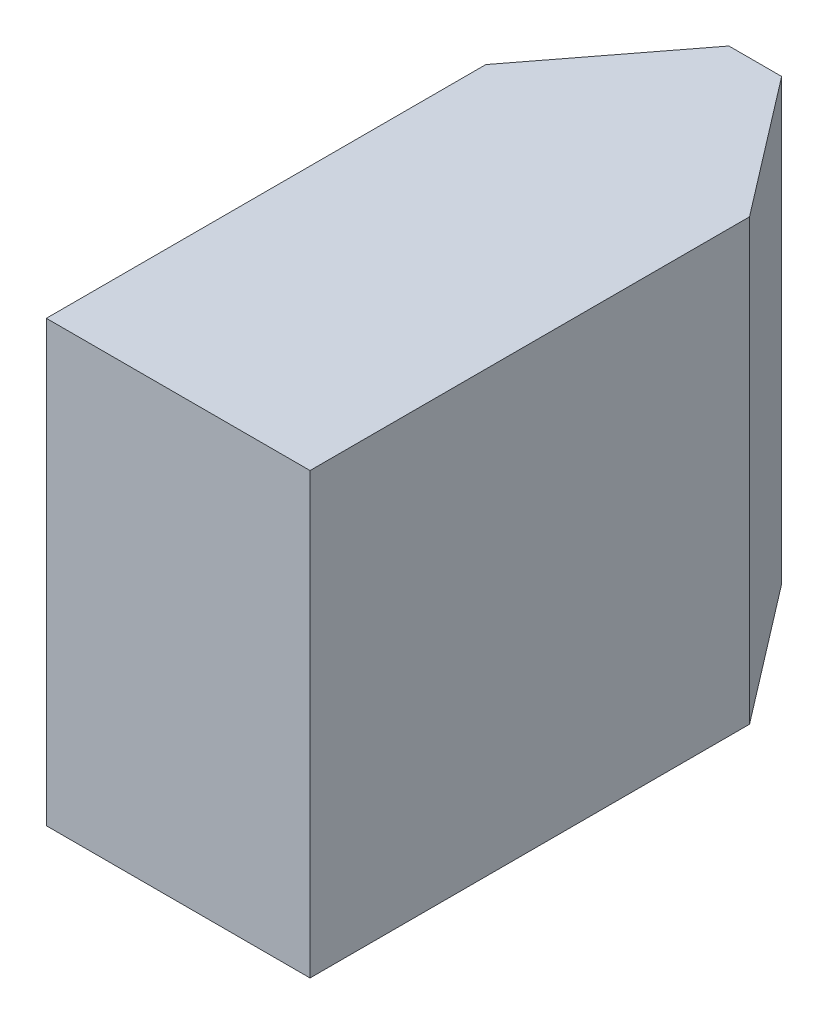
ISO-10303-21;
HEADER;
FILE_DESCRIPTION(('STEP AP214'),'2;1');
FILE_NAME('part.step','',(''),(''),'','','');
FILE_SCHEMA(('AUTOMOTIVE_DESIGN { 1 0 10303 214 1 1 1 1 }'));
ENDSEC;
DATA;
#1=APPLICATION_CONTEXT('core data for automotive mechanical design processes');
#2=APPLICATION_PROTOCOL_DEFINITION('international standard','automotive_design',2000,#1);
#3=PRODUCT_CONTEXT('',#1,'mechanical');
#4=PRODUCT('Part','Part','',(#3));
#5=PRODUCT_RELATED_PRODUCT_CATEGORY('part','',(#4));
#6=PRODUCT_DEFINITION_FORMATION('','',#4);
#7=PRODUCT_DEFINITION_CONTEXT('part definition',#1,'design');
#8=PRODUCT_DEFINITION('design','',#6,#7);
#9=PRODUCT_DEFINITION_SHAPE('','',#8);
#10=(LENGTH_UNIT() NAMED_UNIT(*) SI_UNIT(.MILLI.,.METRE.));
#11=(NAMED_UNIT(*) PLANE_ANGLE_UNIT() SI_UNIT($,.RADIAN.));
#12=(NAMED_UNIT(*) SI_UNIT($,.STERADIAN.) SOLID_ANGLE_UNIT());
#13=UNCERTAINTY_MEASURE_WITH_UNIT(LENGTH_MEASURE(1.E-05),#10,'distance_accuracy_value','');
#14=(GEOMETRIC_REPRESENTATION_CONTEXT(3) GLOBAL_UNCERTAINTY_ASSIGNED_CONTEXT((#13)) GLOBAL_UNIT_ASSIGNED_CONTEXT((#10,
#11,#12)) REPRESENTATION_CONTEXT('',''));
#15=CARTESIAN_POINT('',(0.,0.,0.));
#16=DIRECTION('',(0.,0.,1.));
#17=DIRECTION('',(1.,0.,0.));
#18=AXIS2_PLACEMENT_3D('',#15,#16,#17);
#19=CARTESIAN_POINT('',(-15.,50.,0.));
#20=DIRECTION('',(1.,0.,0.));
#21=DIRECTION('',(0.,0.,-1.));
#22=AXIS2_PLACEMENT_3D('',#19,#20,#21);
#23=PLANE('',#22);
#24=DIRECTION('',(0.,0.,1.));
#25=VECTOR('',#24,1.);
#26=CARTESIAN_POINT('',(-15.,0.,0.));
#27=LINE('',#26,#25);
#28=CARTESIAN_POINT('',(-15.,0.,-50.));
#29=VERTEX_POINT('',#28);
#30=CARTESIAN_POINT('',(-15.,0.,0.));
#31=VERTEX_POINT('',#30);
#32=EDGE_CURVE('E119',#29,#31,#27,.T.);
#33=ORIENTED_EDGE('',*,*,#32,.T.);
#34=DIRECTION('',(0.,-1.,0.));
#35=VECTOR('',#34,1.);
#36=CARTESIAN_POINT('',(-15.,50.,0.));
#37=LINE('',#36,#35);
#38=CARTESIAN_POINT('',(-15.,50.,0.));
#39=VERTEX_POINT('',#38);
#40=EDGE_CURVE('E11',#39,#31,#37,.T.);
#41=ORIENTED_EDGE('',*,*,#40,.F.);
#42=DIRECTION('',(0.,0.,1.));
#43=VECTOR('',#42,1.);
#44=CARTESIAN_POINT('',(-15.,50.,0.));
#45=LINE('',#44,#43);
#46=CARTESIAN_POINT('',(-15.,50.,-50.));
#47=VERTEX_POINT('',#46);
#48=EDGE_CURVE('E129',#47,#39,#45,.T.);
#49=ORIENTED_EDGE('',*,*,#48,.F.);
#50=DIRECTION('',(0.,-1.,0.));
#51=VECTOR('',#50,1.);
#52=CARTESIAN_POINT('',(-15.,50.,-50.));
#53=LINE('',#52,#51);
#54=EDGE_CURVE('E115',#47,#29,#53,.T.);
#55=ORIENTED_EDGE('',*,*,#54,.T.);
#56=EDGE_LOOP('',(#33,#41,#49,#55));
#57=FACE_BOUND('',#56,.T.);
#58=ADVANCED_FACE('F35',(#57),#23,.F.);
#59=CARTESIAN_POINT('',(-15.,50.,0.));
#60=DIRECTION('',(0.,0.,-1.));
#61=DIRECTION('',(-1.,0.,0.));
#62=AXIS2_PLACEMENT_3D('',#59,#60,#61);
#63=PLANE('',#62);
#64=DIRECTION('',(1.,0.,0.));
#65=VECTOR('',#64,1.);
#66=CARTESIAN_POINT('',(-15.,0.,0.));
#67=LINE('',#66,#65);
#68=CARTESIAN_POINT('',(15.,0.,0.));
#69=VERTEX_POINT('',#68);
#70=EDGE_CURVE('E122',#31,#69,#67,.T.);
#71=ORIENTED_EDGE('',*,*,#70,.T.);
#72=DIRECTION('',(0.,-1.,0.));
#73=VECTOR('',#72,1.);
#74=CARTESIAN_POINT('',(15.,50.,0.));
#75=LINE('',#74,#73);
#76=CARTESIAN_POINT('',(15.,50.,0.));
#77=VERTEX_POINT('',#76);
#78=EDGE_CURVE('E43',#77,#69,#75,.T.);
#79=ORIENTED_EDGE('',*,*,#78,.F.);
#80=DIRECTION('',(1.,0.,0.));
#81=VECTOR('',#80,1.);
#82=CARTESIAN_POINT('',(-15.,50.,0.));
#83=LINE('',#82,#81);
#84=EDGE_CURVE('E88',#39,#77,#83,.T.);
#85=ORIENTED_EDGE('',*,*,#84,.F.);
#86=ORIENTED_EDGE('',*,*,#40,.T.);
#87=EDGE_LOOP('',(#71,#79,#85,#86));
#88=FACE_BOUND('',#87,.T.);
#89=ADVANCED_FACE('F153',(#88),#63,.F.);
#90=CARTESIAN_POINT('',(15.,50.,0.));
#91=DIRECTION('',(-1.,0.,0.));
#92=DIRECTION('',(0.,0.,1.));
#93=AXIS2_PLACEMENT_3D('',#90,#91,#92);
#94=PLANE('',#93);
#95=DIRECTION('',(0.,0.,-1.));
#96=VECTOR('',#95,1.);
#97=CARTESIAN_POINT('',(15.,0.,0.));
#98=LINE('',#97,#96);
#99=CARTESIAN_POINT('',(15.,0.,-50.));
#100=VERTEX_POINT('',#99);
#101=EDGE_CURVE('E124',#69,#100,#98,.T.);
#102=ORIENTED_EDGE('',*,*,#101,.T.);
#103=DIRECTION('',(0.,-1.,0.));
#104=VECTOR('',#103,1.);
#105=CARTESIAN_POINT('',(15.,50.,-50.));
#106=LINE('',#105,#104);
#107=CARTESIAN_POINT('',(15.,50.,-50.));
#108=VERTEX_POINT('',#107);
#109=EDGE_CURVE('E110',#108,#100,#106,.T.);
#110=ORIENTED_EDGE('',*,*,#109,.F.);
#111=DIRECTION('',(0.,0.,-1.));
#112=VECTOR('',#111,1.);
#113=CARTESIAN_POINT('',(15.,50.,0.));
#114=LINE('',#113,#112);
#115=EDGE_CURVE('E101',#77,#108,#114,.T.);
#116=ORIENTED_EDGE('',*,*,#115,.F.);
#117=ORIENTED_EDGE('',*,*,#78,.T.);
#118=EDGE_LOOP('',(#102,#110,#116,#117));
#119=FACE_BOUND('',#118,.T.);
#120=ADVANCED_FACE('F135',(#119),#94,.F.);
#121=CARTESIAN_POINT('',(3.,50.,-65.6560148002121));
#122=DIRECTION('',(-0.793678436315689,0.,0.608337521222786));
#123=DIRECTION('',(0.608337521222786,0.,0.793678436315689));
#124=AXIS2_PLACEMENT_3D('',#121,#122,#123);
#125=PLANE('',#124);
#126=DIRECTION('',(-0.608337521222786,0.,-0.793678436315689));
#127=VECTOR('',#126,1.);
#128=CARTESIAN_POINT('',(3.,0.,-65.6560148002121));
#129=LINE('',#128,#127);
#130=CARTESIAN_POINT('',(3.,0.,-65.6560148002121));
#131=VERTEX_POINT('',#130);
#132=EDGE_CURVE('E109',#100,#131,#129,.T.);
#133=ORIENTED_EDGE('',*,*,#132,.T.);
#134=DIRECTION('',(0.,-1.,0.));
#135=VECTOR('',#134,1.);
#136=CARTESIAN_POINT('',(3.,50.,-65.6560148002121));
#137=LINE('',#136,#135);
#138=CARTESIAN_POINT('',(3.,50.,-65.6560148002121));
#139=VERTEX_POINT('',#138);
#140=EDGE_CURVE('E106',#139,#131,#137,.T.);
#141=ORIENTED_EDGE('',*,*,#140,.F.);
#142=DIRECTION('',(-0.608337521222786,0.,-0.793678436315689));
#143=VECTOR('',#142,1.);
#144=CARTESIAN_POINT('',(3.,50.,-65.6560148002121));
#145=LINE('',#144,#143);
#146=EDGE_CURVE('E95',#108,#139,#145,.T.);
#147=ORIENTED_EDGE('',*,*,#146,.F.);
#148=ORIENTED_EDGE('',*,*,#109,.T.);
#149=EDGE_LOOP('',(#133,#141,#147,#148));
#150=FACE_BOUND('',#149,.T.);
#151=ADVANCED_FACE('F107',(#150),#125,.F.);
#152=CARTESIAN_POINT('',(-3.,50.,-65.6560148002121));
#153=DIRECTION('',(0.,0.,1.));
#154=DIRECTION('',(1.,0.,0.));
#155=AXIS2_PLACEMENT_3D('',#152,#153,#154);
#156=PLANE('',#155);
#157=DIRECTION('',(-1.,0.,0.));
#158=VECTOR('',#157,1.);
#159=CARTESIAN_POINT('',(-3.,0.,-65.6560148002121));
#160=LINE('',#159,#158);
#161=CARTESIAN_POINT('',(-3.,0.,-65.6560148002121));
#162=VERTEX_POINT('',#161);
#163=EDGE_CURVE('E74',#131,#162,#160,.T.);
#164=ORIENTED_EDGE('',*,*,#163,.T.);
#165=DIRECTION('',(0.,-1.,0.));
#166=VECTOR('',#165,1.);
#167=CARTESIAN_POINT('',(-3.,50.,-65.6560148002121));
#168=LINE('',#167,#166);
#169=CARTESIAN_POINT('',(-3.,50.,-65.6560148002121));
#170=VERTEX_POINT('',#169);
#171=EDGE_CURVE('E111',#170,#162,#168,.T.);
#172=ORIENTED_EDGE('',*,*,#171,.F.);
#173=DIRECTION('',(-1.,0.,0.));
#174=VECTOR('',#173,1.);
#175=CARTESIAN_POINT('',(-3.,50.,-65.6560148002121));
#176=LINE('',#175,#174);
#177=EDGE_CURVE('E99',#139,#170,#176,.T.);
#178=ORIENTED_EDGE('',*,*,#177,.F.);
#179=ORIENTED_EDGE('',*,*,#140,.T.);
#180=EDGE_LOOP('',(#164,#172,#178,#179));
#181=FACE_BOUND('',#180,.T.);
#182=ADVANCED_FACE('F113',(#181),#156,.F.);
#183=CARTESIAN_POINT('',(-15.,50.,-50.));
#184=DIRECTION('',(0.793678436315689,0.,0.608337521222786));
#185=DIRECTION('',(0.608337521222786,0.,-0.793678436315689));
#186=AXIS2_PLACEMENT_3D('',#183,#184,#185);
#187=PLANE('',#186);
#188=DIRECTION('',(-0.608337521222786,0.,0.793678436315689));
#189=VECTOR('',#188,1.);
#190=CARTESIAN_POINT('',(-15.,0.,-50.));
#191=LINE('',#190,#189);
#192=EDGE_CURVE('E80',#162,#29,#191,.T.);
#193=ORIENTED_EDGE('',*,*,#192,.T.);
#194=ORIENTED_EDGE('',*,*,#54,.F.);
#195=DIRECTION('',(-0.608337521222786,0.,0.793678436315689));
#196=VECTOR('',#195,1.);
#197=CARTESIAN_POINT('',(-15.,50.,-50.));
#198=LINE('',#197,#196);
#199=EDGE_CURVE('E51',#170,#47,#198,.T.);
#200=ORIENTED_EDGE('',*,*,#199,.F.);
#201=ORIENTED_EDGE('',*,*,#171,.T.);
#202=EDGE_LOOP('',(#193,#194,#200,#201));
#203=FACE_BOUND('',#202,.T.);
#204=ADVANCED_FACE('F142',(#203),#187,.F.);
#205=CARTESIAN_POINT('',(0.,50.,0.));
#206=DIRECTION('',(0.,-1.,0.));
#207=DIRECTION('',(0.,0.,-1.));
#208=AXIS2_PLACEMENT_3D('',#205,#206,#207);
#209=PLANE('',#208);
#210=ORIENTED_EDGE('',*,*,#48,.T.);
#211=ORIENTED_EDGE('',*,*,#84,.T.);
#212=ORIENTED_EDGE('',*,*,#115,.T.);
#213=ORIENTED_EDGE('',*,*,#146,.T.);
#214=ORIENTED_EDGE('',*,*,#177,.T.);
#215=ORIENTED_EDGE('',*,*,#199,.T.);
#216=EDGE_LOOP('',(#210,#211,#212,#213,#214,#215));
#217=FACE_BOUND('',#216,.T.);
#218=ADVANCED_FACE('F97',(#217),#209,.F.);
#219=CARTESIAN_POINT('',(0.,0.,0.));
#220=DIRECTION('',(0.,-1.,0.));
#221=DIRECTION('',(0.,0.,-1.));
#222=AXIS2_PLACEMENT_3D('',#219,#220,#221);
#223=PLANE('',#222);
#224=ORIENTED_EDGE('',*,*,#32,.F.);
#225=ORIENTED_EDGE('',*,*,#192,.F.);
#226=ORIENTED_EDGE('',*,*,#163,.F.);
#227=ORIENTED_EDGE('',*,*,#132,.F.);
#228=ORIENTED_EDGE('',*,*,#101,.F.);
#229=ORIENTED_EDGE('',*,*,#70,.F.);
#230=EDGE_LOOP('',(#224,#225,#226,#227,#228,#229));
#231=FACE_BOUND('',#230,.T.);
#232=ADVANCED_FACE('F138',(#231),#223,.T.);
#233=CLOSED_SHELL('',(#58,#89,#120,#151,#182,#204,#218,#232));
#234=MANIFOLD_SOLID_BREP('B2',#233);
#235=ADVANCED_BREP_SHAPE_REPRESENTATION('',(#18,#234),#14);
#236=SHAPE_DEFINITION_REPRESENTATION(#9,#235);
ENDSEC;
END-ISO-10303-21;
